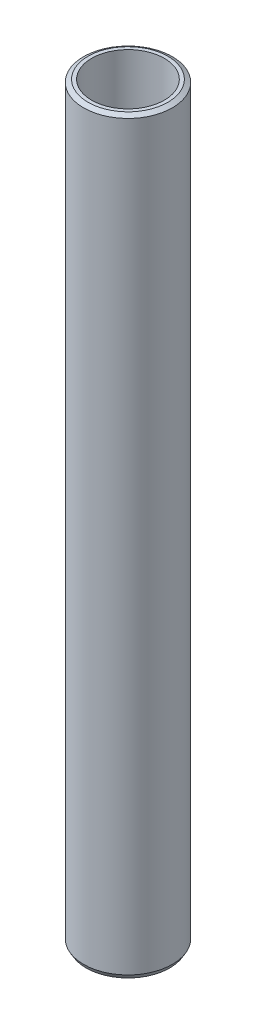
ISO-10303-21;
HEADER;
FILE_DESCRIPTION(('STEP AP214'),'2;1');
FILE_NAME('part.step','',(''),(''),'','','');
FILE_SCHEMA(('AUTOMOTIVE_DESIGN { 1 0 10303 214 1 1 1 1 }'));
ENDSEC;
DATA;
#1=APPLICATION_CONTEXT('core data for automotive mechanical design processes');
#2=APPLICATION_PROTOCOL_DEFINITION('international standard','automotive_design',2000,#1);
#3=PRODUCT_CONTEXT('',#1,'mechanical');
#4=PRODUCT('Part','Part','',(#3));
#5=PRODUCT_RELATED_PRODUCT_CATEGORY('part','',(#4));
#6=PRODUCT_DEFINITION_FORMATION('','',#4);
#7=PRODUCT_DEFINITION_CONTEXT('part definition',#1,'design');
#8=PRODUCT_DEFINITION('design','',#6,#7);
#9=PRODUCT_DEFINITION_SHAPE('','',#8);
#10=(LENGTH_UNIT() NAMED_UNIT(*) SI_UNIT(.MILLI.,.METRE.));
#11=(NAMED_UNIT(*) PLANE_ANGLE_UNIT() SI_UNIT($,.RADIAN.));
#12=(NAMED_UNIT(*) SI_UNIT($,.STERADIAN.) SOLID_ANGLE_UNIT());
#13=UNCERTAINTY_MEASURE_WITH_UNIT(LENGTH_MEASURE(1.E-05),#10,'distance_accuracy_value','');
#14=(GEOMETRIC_REPRESENTATION_CONTEXT(3) GLOBAL_UNCERTAINTY_ASSIGNED_CONTEXT((#13)) GLOBAL_UNIT_ASSIGNED_CONTEXT((#10,
#11,#12)) REPRESENTATION_CONTEXT('',''));
#15=CARTESIAN_POINT('',(0.,0.,0.));
#16=DIRECTION('',(0.,0.,1.));
#17=DIRECTION('',(1.,0.,0.));
#18=AXIS2_PLACEMENT_3D('',#15,#16,#17);
#19=CARTESIAN_POINT('',(0.,548.400233657416,0.));
#20=DIRECTION('',(0.,-1.,0.));
#21=DIRECTION('',(0.,0.,-1.));
#22=AXIS2_PLACEMENT_3D('',#19,#20,#21);
#23=CYLINDRICAL_SURFACE('',#22,32.5);
#24=CARTESIAN_POINT('',(0.,546.515608275858,0.));
#25=DIRECTION('',(0.,1.,0.));
#26=DIRECTION('',(0.,0.,1.));
#27=AXIS2_PLACEMENT_3D('',#24,#25,#26);
#28=CIRCLE('',#27,32.5);
#29=CARTESIAN_POINT('',(0.,546.515608275858,32.5));
#30=VERTEX_POINT('',#29);
#31=EDGE_CURVE('E50',#30,#30,#28,.F.);
#32=ORIENTED_EDGE('',*,*,#31,.T.);
#33=EDGE_LOOP('',(#32));
#34=FACE_BOUND('',#33,.T.);
#35=CARTESIAN_POINT('',(0.,3.26426691409387,0.));
#36=DIRECTION('',(0.,1.,0.));
#37=DIRECTION('',(0.,0.,1.));
#38=AXIS2_PLACEMENT_3D('',#35,#36,#37);
#39=CIRCLE('',#38,32.5);
#40=CARTESIAN_POINT('',(0.,3.26426691409387,32.5));
#41=VERTEX_POINT('',#40);
#42=EDGE_CURVE('E51',#41,#41,#39,.T.);
#43=ORIENTED_EDGE('',*,*,#42,.T.);
#44=EDGE_LOOP('',(#43));
#45=FACE_BOUND('',#44,.T.);
#46=ADVANCED_FACE('F39',(#34,#45),#23,.T.);
#47=CARTESIAN_POINT('',(0.,548.400233657416,0.));
#48=DIRECTION('',(0.,1.,0.));
#49=DIRECTION('',(0.,0.,1.));
#50=AXIS2_PLACEMENT_3D('',#47,#48,#49);
#51=PLANE('',#50);
#52=CARTESIAN_POINT('',(0.,548.400233657416,0.));
#53=DIRECTION('',(0.,1.,0.));
#54=DIRECTION('',(0.,0.,1.));
#55=AXIS2_PLACEMENT_3D('',#52,#53,#54);
#56=CIRCLE('',#55,29.2357330859059);
#57=CARTESIAN_POINT('',(0.,548.400233657416,29.2357330859059));
#58=VERTEX_POINT('',#57);
#59=EDGE_CURVE('E54',#58,#58,#56,.T.);
#60=ORIENTED_EDGE('',*,*,#59,.T.);
#61=EDGE_LOOP('',(#60));
#62=FACE_BOUND('',#61,.T.);
#63=CARTESIAN_POINT('',(0.,548.400233657416,0.));
#64=DIRECTION('',(0.,1.,0.));
#65=DIRECTION('',(0.,0.,1.));
#66=AXIS2_PLACEMENT_3D('',#63,#64,#65);
#67=CIRCLE('',#66,26.6193422000637);
#68=CARTESIAN_POINT('',(0.,548.400233657416,26.6193422000637));
#69=VERTEX_POINT('',#68);
#70=EDGE_CURVE('E58',#69,#69,#67,.T.);
#71=ORIENTED_EDGE('',*,*,#70,.F.);
#72=EDGE_LOOP('',(#71));
#73=FACE_BOUND('',#72,.T.);
#74=ADVANCED_FACE('F69',(#62,#73),#51,.T.);
#75=CARTESIAN_POINT('',(0.,0.,0.));
#76=DIRECTION('',(0.,1.,0.));
#77=DIRECTION('',(0.,0.,1.));
#78=AXIS2_PLACEMENT_3D('',#75,#76,#77);
#79=PLANE('',#78);
#80=CARTESIAN_POINT('',(0.,0.,0.));
#81=DIRECTION('',(0.,1.,0.));
#82=DIRECTION('',(0.,0.,1.));
#83=AXIS2_PLACEMENT_3D('',#80,#81,#82);
#84=CIRCLE('',#83,30.6153746184411);
#85=CARTESIAN_POINT('',(0.,0.,30.6153746184411));
#86=VERTEX_POINT('',#85);
#87=EDGE_CURVE('E10',#86,#86,#84,.F.);
#88=ORIENTED_EDGE('',*,*,#87,.T.);
#89=EDGE_LOOP('',(#88));
#90=FACE_BOUND('',#89,.T.);
#91=CARTESIAN_POINT('',(0.,0.,0.));
#92=DIRECTION('',(0.,1.,0.));
#93=DIRECTION('',(0.,0.,1.));
#94=AXIS2_PLACEMENT_3D('',#91,#92,#93);
#95=CIRCLE('',#94,26.6193422000637);
#96=CARTESIAN_POINT('',(0.,0.,26.6193422000637));
#97=VERTEX_POINT('',#96);
#98=EDGE_CURVE('E63',#97,#97,#95,.T.);
#99=ORIENTED_EDGE('',*,*,#98,.T.);
#100=EDGE_LOOP('',(#99));
#101=FACE_BOUND('',#100,.T.);
#102=ADVANCED_FACE('F75',(#90,#101),#79,.F.);
#103=CARTESIAN_POINT('',(0.,548.400233657416,0.));
#104=DIRECTION('',(0.,-1.,0.));
#105=DIRECTION('',(0.,0.,-1.));
#106=AXIS2_PLACEMENT_3D('',#103,#104,#105);
#107=CYLINDRICAL_SURFACE('',#106,26.6193422000637);
#108=ORIENTED_EDGE('',*,*,#70,.T.);
#109=EDGE_LOOP('',(#108));
#110=FACE_BOUND('',#109,.T.);
#111=ORIENTED_EDGE('',*,*,#98,.F.);
#112=EDGE_LOOP('',(#111));
#113=FACE_BOUND('',#112,.T.);
#114=ADVANCED_FACE('F70',(#110,#113),#107,.F.);
#115=CARTESIAN_POINT('',(0.,548.400233657416,0.));
#116=DIRECTION('',(0.,-1.,0.));
#117=DIRECTION('',(0.,0.,-1.));
#118=AXIS2_PLACEMENT_3D('',#115,#116,#117);
#119=CONICAL_SURFACE('',#118,29.2357330859059,1.0471975511966);
#120=ORIENTED_EDGE('',*,*,#31,.F.);
#121=EDGE_LOOP('',(#120));
#122=FACE_BOUND('',#121,.T.);
#123=ORIENTED_EDGE('',*,*,#59,.F.);
#124=EDGE_LOOP('',(#123));
#125=FACE_BOUND('',#124,.T.);
#126=ADVANCED_FACE('F81',(#122,#125),#119,.T.);
#127=CARTESIAN_POINT('',(0.,3.26426691409387,0.));
#128=DIRECTION('',(0.,1.,0.));
#129=DIRECTION('',(0.,0.,1.));
#130=AXIS2_PLACEMENT_3D('',#127,#128,#129);
#131=CONICAL_SURFACE('',#130,32.5,0.523598775598301);
#132=CARTESIAN_POINT('',(0.,0.,30.6153746184411));
#133=CARTESIAN_POINT('',(0.,0.0340027803551438,30.6350061328323));
#134=CARTESIAN_POINT('',(0.,0.0680055607102884,30.6546376472236));
#135=CARTESIAN_POINT('',(0.,0.136011121420578,30.6939006760061));
#136=CARTESIAN_POINT('',(0.,0.170013901775722,30.7135321903973));
#137=CARTESIAN_POINT('',(0.,0.238019462486011,30.7527952191798));
#138=CARTESIAN_POINT('',(0.,0.272022242841155,30.772426733571));
#139=CARTESIAN_POINT('',(0.,0.340027803551444,30.8116897623535));
#140=CARTESIAN_POINT('',(0.,0.374030583906589,30.8313212767447));
#141=CARTESIAN_POINT('',(0.,0.442036144616878,30.8705843055272));
#142=CARTESIAN_POINT('',(0.,0.476038924972022,30.8902158199184));
#143=CARTESIAN_POINT('',(0.,0.544044485682312,30.9294788487009));
#144=CARTESIAN_POINT('',(0.,0.578047266037456,30.9491103630922));
#145=CARTESIAN_POINT('',(0.,0.646052826747745,30.9883733918746));
#146=CARTESIAN_POINT('',(0.,0.680055607102889,31.0080049062659));
#147=CARTESIAN_POINT('',(0.,0.748061167813178,31.0472679350483));
#148=CARTESIAN_POINT('',(0.,0.782063948168323,31.0668994494396));
#149=CARTESIAN_POINT('',(0.,0.850069508878612,31.1061624782221));
#150=CARTESIAN_POINT('',(0.,0.884072289233756,31.1257939926133));
#151=CARTESIAN_POINT('',(0.,0.952077849944046,31.1650570213958));
#152=CARTESIAN_POINT('',(0.,0.98608063029919,31.184688535787));
#153=CARTESIAN_POINT('',(0.,1.05408619100948,31.2239515645695));
#154=CARTESIAN_POINT('',(0.,1.08808897136462,31.2435830789607));
#155=CARTESIAN_POINT('',(0.,1.15609453207491,31.2828461077432));
#156=CARTESIAN_POINT('',(0.,1.19009731243006,31.3024776221345));
#157=CARTESIAN_POINT('',(0.,1.25810287314035,31.3417406509169));
#158=CARTESIAN_POINT('',(0.,1.29210565349549,31.3613721653082));
#159=CARTESIAN_POINT('',(0.,1.36011121420578,31.4006351940906));
#160=CARTESIAN_POINT('',(0.,1.39411399456092,31.4202667084819));
#161=CARTESIAN_POINT('',(0.,1.46211955527121,31.4595297372644));
#162=CARTESIAN_POINT('',(0.,1.49612233562636,31.4791612516556));
#163=CARTESIAN_POINT('',(0.,1.56412789633665,31.5184242804381));
#164=CARTESIAN_POINT('',(0.,1.59813067669179,31.5380557948293));
#165=CARTESIAN_POINT('',(0.,1.66613623740208,31.5773188236118));
#166=CARTESIAN_POINT('',(0.,1.70013901775722,31.596950338003));
#167=CARTESIAN_POINT('',(0.,1.76814457846751,31.6362133667855));
#168=CARTESIAN_POINT('',(0.,1.80214735882266,31.6558448811767));
#169=CARTESIAN_POINT('',(0.,1.87015291953295,31.6951079099592));
#170=CARTESIAN_POINT('',(0.,1.90415569988809,31.7147394243505));
#171=CARTESIAN_POINT('',(0.,1.97216126059838,31.7540024531329));
#172=CARTESIAN_POINT('',(0.,2.00616404095353,31.7736339675242));
#173=CARTESIAN_POINT('',(0.,2.07416960166382,31.8128969963066));
#174=CARTESIAN_POINT('',(0.,2.10817238201896,31.8325285106979));
#175=CARTESIAN_POINT('',(0.,2.17617794272925,31.8717915394804));
#176=CARTESIAN_POINT('',(0.,2.21018072308439,31.8914230538716));
#177=CARTESIAN_POINT('',(0.,2.27818628379468,31.9306860826541));
#178=CARTESIAN_POINT('',(0.,2.31218906414983,31.9503175970453));
#179=CARTESIAN_POINT('',(0.,2.38019462486012,31.9895806258278));
#180=CARTESIAN_POINT('',(0.,2.41419740521526,32.009212140219));
#181=CARTESIAN_POINT('',(0.,2.48220296592555,32.0484751690015));
#182=CARTESIAN_POINT('',(0.,2.51620574628069,32.0681066833928));
#183=CARTESIAN_POINT('',(0.,2.58421130699098,32.1073697121752));
#184=CARTESIAN_POINT('',(0.,2.61821408734613,32.1270012265665));
#185=CARTESIAN_POINT('',(0.,2.68621964805642,32.1662642553489));
#186=CARTESIAN_POINT('',(0.,2.72022242841156,32.1858957697402));
#187=CARTESIAN_POINT('',(0.,2.78822798912185,32.2251587985227));
#188=CARTESIAN_POINT('',(0.,2.82223076947699,32.2447903129139));
#189=CARTESIAN_POINT('',(0.,2.89023633018728,32.2840533416964));
#190=CARTESIAN_POINT('',(0.,2.92423911054243,32.3036848560876));
#191=CARTESIAN_POINT('',(0.,2.99224467125272,32.3429478848701));
#192=CARTESIAN_POINT('',(0.,3.02624745160786,32.3625793992613));
#193=CARTESIAN_POINT('',(0.,3.09425301231815,32.4018424280438));
#194=CARTESIAN_POINT('',(0.,3.12825579267329,32.421473942435));
#195=CARTESIAN_POINT('',(0.,3.19626135338358,32.4607369712175));
#196=CARTESIAN_POINT('',(0.,3.23026413373873,32.4803684856088));
#197=CARTESIAN_POINT('',(0.,3.26426691409387,32.5));
#198=B_SPLINE_CURVE_WITH_KNOTS('',3,(#132,#133,#134,#135,#136,#137,#138,#139,#140,#141,#142,
#143,#144,#145,#146,#147,#148,#149,#150,#151,#152,#153,#154,#155,#156,#157,#158,#159,#160,#161,
#162,#163,#164,#165,#166,#167,#168,#169,#170,#171,#172,#173,#174,#175,#176,#177,#178,#179,#180,
#181,#182,#183,#184,#185,#186,#187,#188,#189,#190,#191,#192,#193,#194,#195,#196,#197),
.UNSPECIFIED.,.F.,.F.,(4,2,2,2,2,2,2,2,2,2,2,2,2,2,2,2,2,2,2,2,2,2,2,2,2,2,2,2,2,2,2,2,4),(0.,
0.11778908634743,0.23557817269486,0.353367259042292,0.471156345389722,0.588945431737152,
0.706734518084582,0.824523604432014,0.942312690779444,1.06010177712687,1.1778908634743,
1.29567994982174,1.41346903616916,1.5312581225166,1.64904720886403,1.76683629521146,
1.88462538155889,2.00241446790632,2.12020355425375,2.23799264060118,2.35578172694861,
2.47357081329604,2.59135989964347,2.7091489859909,2.82693807233833,2.94472715868577,
3.06251624503319,3.18030533138063,3.29809441772805,3.41588350407549,3.53367259042292,
3.65146167677035,3.76925076311778),.UNSPECIFIED.);
#199=EDGE_CURVE('BSEAM45',#86,#41,#198,.T.);
#200=ORIENTED_EDGE('',*,*,#87,.F.);
#201=ORIENTED_EDGE('',*,*,#42,.F.);
#202=ORIENTED_EDGE('',*,*,#199,.T.);
#203=ORIENTED_EDGE('',*,*,#199,.F.);
#204=EDGE_LOOP('',(#200,#202,#201,#203));
#205=FACE_BOUND('',#204,.T.);
#206=ADVANCED_FACE('F45',(#205),#131,.T.);
#207=CLOSED_SHELL('',(#46,#74,#102,#114,#126,#206));
#208=MANIFOLD_SOLID_BREP('B2',#207);
#209=ADVANCED_BREP_SHAPE_REPRESENTATION('',(#18,#208),#14);
#210=SHAPE_DEFINITION_REPRESENTATION(#9,#209);
ENDSEC;
END-ISO-10303-21;
